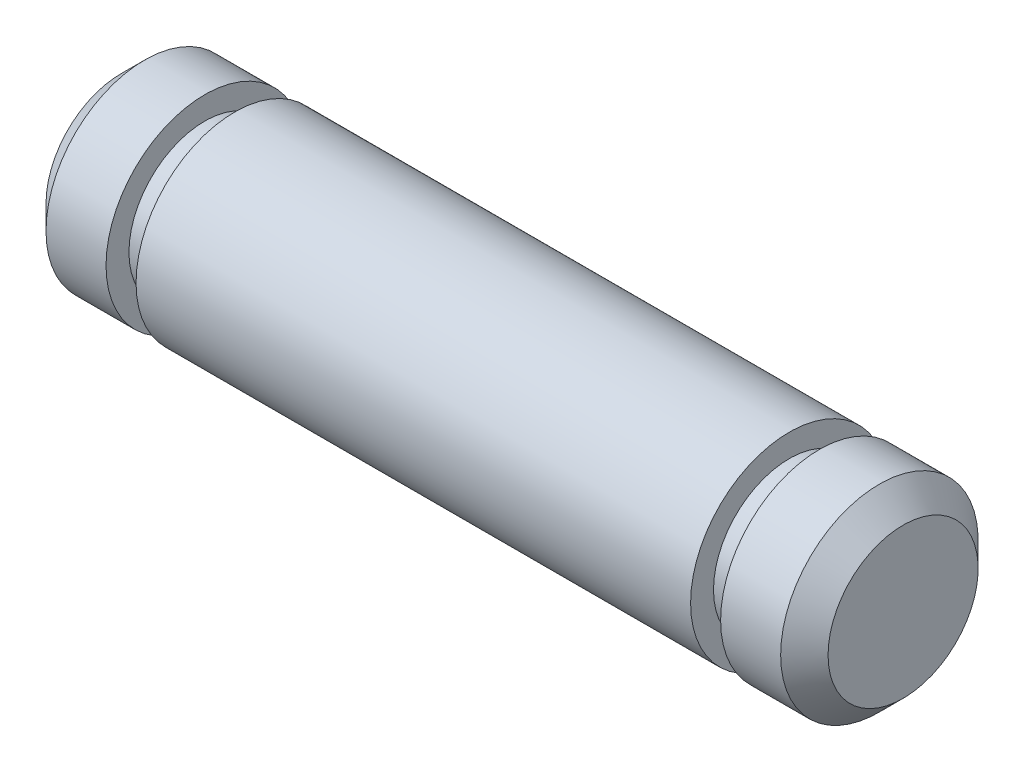
ISO-10303-21;
HEADER;
FILE_DESCRIPTION(('STEP AP214'),'2;1');
FILE_NAME('part.step','',(''),(''),'','','');
FILE_SCHEMA(('AUTOMOTIVE_DESIGN { 1 0 10303 214 1 1 1 1 }'));
ENDSEC;
DATA;
#1=APPLICATION_CONTEXT('core data for automotive mechanical design processes');
#2=APPLICATION_PROTOCOL_DEFINITION('international standard','automotive_design',2000,#1);
#3=PRODUCT_CONTEXT('',#1,'mechanical');
#4=PRODUCT('Part','Part','',(#3));
#5=PRODUCT_RELATED_PRODUCT_CATEGORY('part','',(#4));
#6=PRODUCT_DEFINITION_FORMATION('','',#4);
#7=PRODUCT_DEFINITION_CONTEXT('part definition',#1,'design');
#8=PRODUCT_DEFINITION('design','',#6,#7);
#9=PRODUCT_DEFINITION_SHAPE('','',#8);
#10=(LENGTH_UNIT() NAMED_UNIT(*) SI_UNIT(.MILLI.,.METRE.));
#11=(NAMED_UNIT(*) PLANE_ANGLE_UNIT() SI_UNIT($,.RADIAN.));
#12=(NAMED_UNIT(*) SI_UNIT($,.STERADIAN.) SOLID_ANGLE_UNIT());
#13=UNCERTAINTY_MEASURE_WITH_UNIT(LENGTH_MEASURE(1.E-05),#10,'distance_accuracy_value','');
#14=(GEOMETRIC_REPRESENTATION_CONTEXT(3) GLOBAL_UNCERTAINTY_ASSIGNED_CONTEXT((#13)) GLOBAL_UNIT_ASSIGNED_CONTEXT((#10,
#11,#12)) REPRESENTATION_CONTEXT('',''));
#15=CARTESIAN_POINT('',(0.,0.,0.));
#16=DIRECTION('',(0.,0.,1.));
#17=DIRECTION('',(1.,0.,0.));
#18=AXIS2_PLACEMENT_3D('',#15,#16,#17);
#19=CARTESIAN_POINT('',(-6.2865,0.,0.));
#20=DIRECTION('',(1.,0.,0.));
#21=DIRECTION('',(0.,0.,-1.));
#22=AXIS2_PLACEMENT_3D('',#19,#20,#21);
#23=PLANE('',#22);
#24=CARTESIAN_POINT('',(-6.2865,0.,0.));
#25=DIRECTION('',(-1.,0.,0.));
#26=DIRECTION('',(0.,0.,1.));
#27=AXIS2_PLACEMENT_3D('',#24,#25,#26);
#28=CIRCLE('',#27,1.2065);
#29=CARTESIAN_POINT('',(-6.2865,0.,1.2065));
#30=VERTEX_POINT('',#29);
#31=EDGE_CURVE('E10',#30,#30,#28,.T.);
#32=ORIENTED_EDGE('',*,*,#31,.T.);
#33=EDGE_LOOP('',(#32));
#34=FACE_BOUND('',#33,.T.);
#35=ADVANCED_FACE('F33',(#34),#23,.F.);
#36=CARTESIAN_POINT('',(-5.9055,0.,0.));
#37=DIRECTION('',(1.,0.,0.));
#38=DIRECTION('',(0.,0.,-1.));
#39=AXIS2_PLACEMENT_3D('',#36,#37,#38);
#40=CONICAL_SURFACE('',#39,1.5875,0.785398163397449);
#41=ORIENTED_EDGE('',*,*,#31,.F.);
#42=EDGE_LOOP('',(#41));
#43=FACE_BOUND('',#42,.T.);
#44=CARTESIAN_POINT('',(-5.9055,0.,0.));
#45=DIRECTION('',(-1.,0.,0.));
#46=DIRECTION('',(0.,0.,1.));
#47=AXIS2_PLACEMENT_3D('',#44,#45,#46);
#48=CIRCLE('',#47,1.5875);
#49=CARTESIAN_POINT('',(-5.9055,0.,1.5875));
#50=VERTEX_POINT('',#49);
#51=EDGE_CURVE('E39',#50,#50,#48,.T.);
#52=ORIENTED_EDGE('',*,*,#51,.T.);
#53=EDGE_LOOP('',(#52));
#54=FACE_BOUND('',#53,.T.);
#55=ADVANCED_FACE('F89',(#43,#54),#40,.T.);
#56=CARTESIAN_POINT('',(6.2865,0.,0.));
#57=DIRECTION('',(-1.,0.,0.));
#58=DIRECTION('',(0.,0.,1.));
#59=AXIS2_PLACEMENT_3D('',#56,#57,#58);
#60=CYLINDRICAL_SURFACE('',#59,1.5875);
#61=ORIENTED_EDGE('',*,*,#51,.F.);
#62=EDGE_LOOP('',(#61));
#63=FACE_BOUND('',#62,.T.);
#64=CARTESIAN_POINT('',(-4.9403,0.,0.));
#65=DIRECTION('',(-1.,0.,0.));
#66=DIRECTION('',(0.,0.,1.));
#67=AXIS2_PLACEMENT_3D('',#64,#65,#66);
#68=CIRCLE('',#67,1.5875);
#69=CARTESIAN_POINT('',(-4.9403,0.,1.5875));
#70=VERTEX_POINT('',#69);
#71=EDGE_CURVE('E43',#70,#70,#68,.T.);
#72=ORIENTED_EDGE('',*,*,#71,.T.);
#73=EDGE_LOOP('',(#72));
#74=FACE_BOUND('',#73,.T.);
#75=ADVANCED_FACE('F93',(#63,#74),#60,.T.);
#76=CARTESIAN_POINT('',(-4.9403,1.5875,0.));
#77=DIRECTION('',(-1.,0.,0.));
#78=DIRECTION('',(0.,0.,1.));
#79=AXIS2_PLACEMENT_3D('',#76,#77,#78);
#80=PLANE('',#79);
#81=ORIENTED_EDGE('',*,*,#71,.F.);
#82=EDGE_LOOP('',(#81));
#83=FACE_BOUND('',#82,.T.);
#84=CARTESIAN_POINT('',(-4.9403,0.,0.));
#85=DIRECTION('',(-1.,0.,0.));
#86=DIRECTION('',(0.,0.,1.));
#87=AXIS2_PLACEMENT_3D('',#84,#85,#86);
#88=CIRCLE('',#87,1.2192);
#89=CARTESIAN_POINT('',(-4.9403,0.,1.2192));
#90=VERTEX_POINT('',#89);
#91=EDGE_CURVE('E47',#90,#90,#88,.T.);
#92=ORIENTED_EDGE('',*,*,#91,.T.);
#93=EDGE_LOOP('',(#92));
#94=FACE_BOUND('',#93,.T.);
#95=ADVANCED_FACE('F98',(#83,#94),#80,.F.);
#96=CARTESIAN_POINT('',(6.2865,0.,0.));
#97=DIRECTION('',(-1.,0.,0.));
#98=DIRECTION('',(0.,0.,1.));
#99=AXIS2_PLACEMENT_3D('',#96,#97,#98);
#100=CYLINDRICAL_SURFACE('',#99,1.2192);
#101=ORIENTED_EDGE('',*,*,#91,.F.);
#102=EDGE_LOOP('',(#101));
#103=FACE_BOUND('',#102,.T.);
#104=CARTESIAN_POINT('',(-4.4577,0.,0.));
#105=DIRECTION('',(-1.,0.,0.));
#106=DIRECTION('',(0.,0.,1.));
#107=AXIS2_PLACEMENT_3D('',#104,#105,#106);
#108=CIRCLE('',#107,1.2192);
#109=CARTESIAN_POINT('',(-4.4577,0.,1.2192));
#110=VERTEX_POINT('',#109);
#111=EDGE_CURVE('E52',#110,#110,#108,.T.);
#112=ORIENTED_EDGE('',*,*,#111,.T.);
#113=EDGE_LOOP('',(#112));
#114=FACE_BOUND('',#113,.T.);
#115=ADVANCED_FACE('F104',(#103,#114),#100,.T.);
#116=CARTESIAN_POINT('',(-4.4577,1.2192,0.));
#117=DIRECTION('',(1.,0.,0.));
#118=DIRECTION('',(0.,0.,-1.));
#119=AXIS2_PLACEMENT_3D('',#116,#117,#118);
#120=PLANE('',#119);
#121=ORIENTED_EDGE('',*,*,#111,.F.);
#122=EDGE_LOOP('',(#121));
#123=FACE_BOUND('',#122,.T.);
#124=CARTESIAN_POINT('',(-4.4577,0.,0.));
#125=DIRECTION('',(-1.,0.,0.));
#126=DIRECTION('',(0.,0.,1.));
#127=AXIS2_PLACEMENT_3D('',#124,#125,#126);
#128=CIRCLE('',#127,1.5875);
#129=CARTESIAN_POINT('',(-4.4577,0.,1.5875));
#130=VERTEX_POINT('',#129);
#131=EDGE_CURVE('E55',#130,#130,#128,.T.);
#132=ORIENTED_EDGE('',*,*,#131,.T.);
#133=EDGE_LOOP('',(#132));
#134=FACE_BOUND('',#133,.T.);
#135=ADVANCED_FACE('F108',(#123,#134),#120,.F.);
#136=CARTESIAN_POINT('',(6.2865,0.,0.));
#137=DIRECTION('',(-1.,0.,0.));
#138=DIRECTION('',(0.,0.,1.));
#139=AXIS2_PLACEMENT_3D('',#136,#137,#138);
#140=CYLINDRICAL_SURFACE('',#139,1.5875);
#141=ORIENTED_EDGE('',*,*,#131,.F.);
#142=EDGE_LOOP('',(#141));
#143=FACE_BOUND('',#142,.T.);
#144=CARTESIAN_POINT('',(4.4577,0.,0.));
#145=DIRECTION('',(-1.,0.,0.));
#146=DIRECTION('',(0.,0.,1.));
#147=AXIS2_PLACEMENT_3D('',#144,#145,#146);
#148=CIRCLE('',#147,1.5875);
#149=CARTESIAN_POINT('',(4.4577,0.,1.5875));
#150=VERTEX_POINT('',#149);
#151=EDGE_CURVE('E58',#150,#150,#148,.T.);
#152=ORIENTED_EDGE('',*,*,#151,.T.);
#153=EDGE_LOOP('',(#152));
#154=FACE_BOUND('',#153,.T.);
#155=ADVANCED_FACE('F112',(#143,#154),#140,.T.);
#156=CARTESIAN_POINT('',(4.4577,1.5875,0.));
#157=DIRECTION('',(-1.,0.,0.));
#158=DIRECTION('',(0.,0.,1.));
#159=AXIS2_PLACEMENT_3D('',#156,#157,#158);
#160=PLANE('',#159);
#161=ORIENTED_EDGE('',*,*,#151,.F.);
#162=EDGE_LOOP('',(#161));
#163=FACE_BOUND('',#162,.T.);
#164=CARTESIAN_POINT('',(4.4577,0.,0.));
#165=DIRECTION('',(-1.,0.,0.));
#166=DIRECTION('',(0.,0.,1.));
#167=AXIS2_PLACEMENT_3D('',#164,#165,#166);
#168=CIRCLE('',#167,1.2192);
#169=CARTESIAN_POINT('',(4.4577,0.,1.2192));
#170=VERTEX_POINT('',#169);
#171=EDGE_CURVE('E61',#170,#170,#168,.T.);
#172=ORIENTED_EDGE('',*,*,#171,.T.);
#173=EDGE_LOOP('',(#172));
#174=FACE_BOUND('',#173,.T.);
#175=ADVANCED_FACE('F116',(#163,#174),#160,.F.);
#176=CARTESIAN_POINT('',(6.2865,0.,0.));
#177=DIRECTION('',(-1.,0.,0.));
#178=DIRECTION('',(0.,0.,1.));
#179=AXIS2_PLACEMENT_3D('',#176,#177,#178);
#180=CYLINDRICAL_SURFACE('',#179,1.2192);
#181=ORIENTED_EDGE('',*,*,#171,.F.);
#182=EDGE_LOOP('',(#181));
#183=FACE_BOUND('',#182,.T.);
#184=CARTESIAN_POINT('',(4.9403,0.,0.));
#185=DIRECTION('',(-1.,0.,0.));
#186=DIRECTION('',(0.,0.,1.));
#187=AXIS2_PLACEMENT_3D('',#184,#185,#186);
#188=CIRCLE('',#187,1.2192);
#189=CARTESIAN_POINT('',(4.9403,0.,1.2192));
#190=VERTEX_POINT('',#189);
#191=EDGE_CURVE('E64',#190,#190,#188,.T.);
#192=ORIENTED_EDGE('',*,*,#191,.T.);
#193=EDGE_LOOP('',(#192));
#194=FACE_BOUND('',#193,.T.);
#195=ADVANCED_FACE('F120',(#183,#194),#180,.T.);
#196=CARTESIAN_POINT('',(4.9403,1.2192,0.));
#197=DIRECTION('',(1.,0.,0.));
#198=DIRECTION('',(0.,0.,-1.));
#199=AXIS2_PLACEMENT_3D('',#196,#197,#198);
#200=PLANE('',#199);
#201=ORIENTED_EDGE('',*,*,#191,.F.);
#202=EDGE_LOOP('',(#201));
#203=FACE_BOUND('',#202,.T.);
#204=CARTESIAN_POINT('',(4.9403,0.,0.));
#205=DIRECTION('',(-1.,0.,0.));
#206=DIRECTION('',(0.,0.,1.));
#207=AXIS2_PLACEMENT_3D('',#204,#205,#206);
#208=CIRCLE('',#207,1.5875);
#209=CARTESIAN_POINT('',(4.9403,0.,1.5875));
#210=VERTEX_POINT('',#209);
#211=EDGE_CURVE('E67',#210,#210,#208,.T.);
#212=ORIENTED_EDGE('',*,*,#211,.T.);
#213=EDGE_LOOP('',(#212));
#214=FACE_BOUND('',#213,.T.);
#215=ADVANCED_FACE('F124',(#203,#214),#200,.F.);
#216=CARTESIAN_POINT('',(6.2865,0.,0.));
#217=DIRECTION('',(-1.,0.,0.));
#218=DIRECTION('',(0.,0.,1.));
#219=AXIS2_PLACEMENT_3D('',#216,#217,#218);
#220=CYLINDRICAL_SURFACE('',#219,1.5875);
#221=ORIENTED_EDGE('',*,*,#211,.F.);
#222=EDGE_LOOP('',(#221));
#223=FACE_BOUND('',#222,.T.);
#224=CARTESIAN_POINT('',(5.9055,0.,0.));
#225=DIRECTION('',(-1.,0.,0.));
#226=DIRECTION('',(0.,0.,1.));
#227=AXIS2_PLACEMENT_3D('',#224,#225,#226);
#228=CIRCLE('',#227,1.5875);
#229=CARTESIAN_POINT('',(5.9055,0.,1.5875));
#230=VERTEX_POINT('',#229);
#231=EDGE_CURVE('E70',#230,#230,#228,.T.);
#232=ORIENTED_EDGE('',*,*,#231,.T.);
#233=EDGE_LOOP('',(#232));
#234=FACE_BOUND('',#233,.T.);
#235=ADVANCED_FACE('F85',(#223,#234),#220,.T.);
#236=CARTESIAN_POINT('',(6.2865,0.,0.));
#237=DIRECTION('',(-1.,0.,0.));
#238=DIRECTION('',(0.,0.,1.));
#239=AXIS2_PLACEMENT_3D('',#236,#237,#238);
#240=CONICAL_SURFACE('',#239,1.2065,0.785398163397448);
#241=ORIENTED_EDGE('',*,*,#231,.F.);
#242=EDGE_LOOP('',(#241));
#243=FACE_BOUND('',#242,.T.);
#244=CARTESIAN_POINT('',(6.2865,0.,0.));
#245=DIRECTION('',(-1.,0.,0.));
#246=DIRECTION('',(0.,0.,1.));
#247=AXIS2_PLACEMENT_3D('',#244,#245,#246);
#248=CIRCLE('',#247,1.2065);
#249=CARTESIAN_POINT('',(6.2865,0.,1.2065));
#250=VERTEX_POINT('',#249);
#251=EDGE_CURVE('E73',#250,#250,#248,.T.);
#252=ORIENTED_EDGE('',*,*,#251,.T.);
#253=EDGE_LOOP('',(#252));
#254=FACE_BOUND('',#253,.T.);
#255=ADVANCED_FACE('F77',(#243,#254),#240,.T.);
#256=CARTESIAN_POINT('',(6.2865,1.2065,0.));
#257=DIRECTION('',(-1.,0.,0.));
#258=DIRECTION('',(0.,0.,1.));
#259=AXIS2_PLACEMENT_3D('',#256,#257,#258);
#260=PLANE('',#259);
#261=ORIENTED_EDGE('',*,*,#251,.F.);
#262=EDGE_LOOP('',(#261));
#263=FACE_BOUND('',#262,.T.);
#264=ADVANCED_FACE('F79',(#263),#260,.F.);
#265=CLOSED_SHELL('',(#35,#55,#75,#95,#115,#135,#155,#175,#195,#215,#235,#255,#264));
#266=MANIFOLD_SOLID_BREP('B2',#265);
#267=ADVANCED_BREP_SHAPE_REPRESENTATION('',(#18,#266),#14);
#268=SHAPE_DEFINITION_REPRESENTATION(#9,#267);
ENDSEC;
END-ISO-10303-21;
